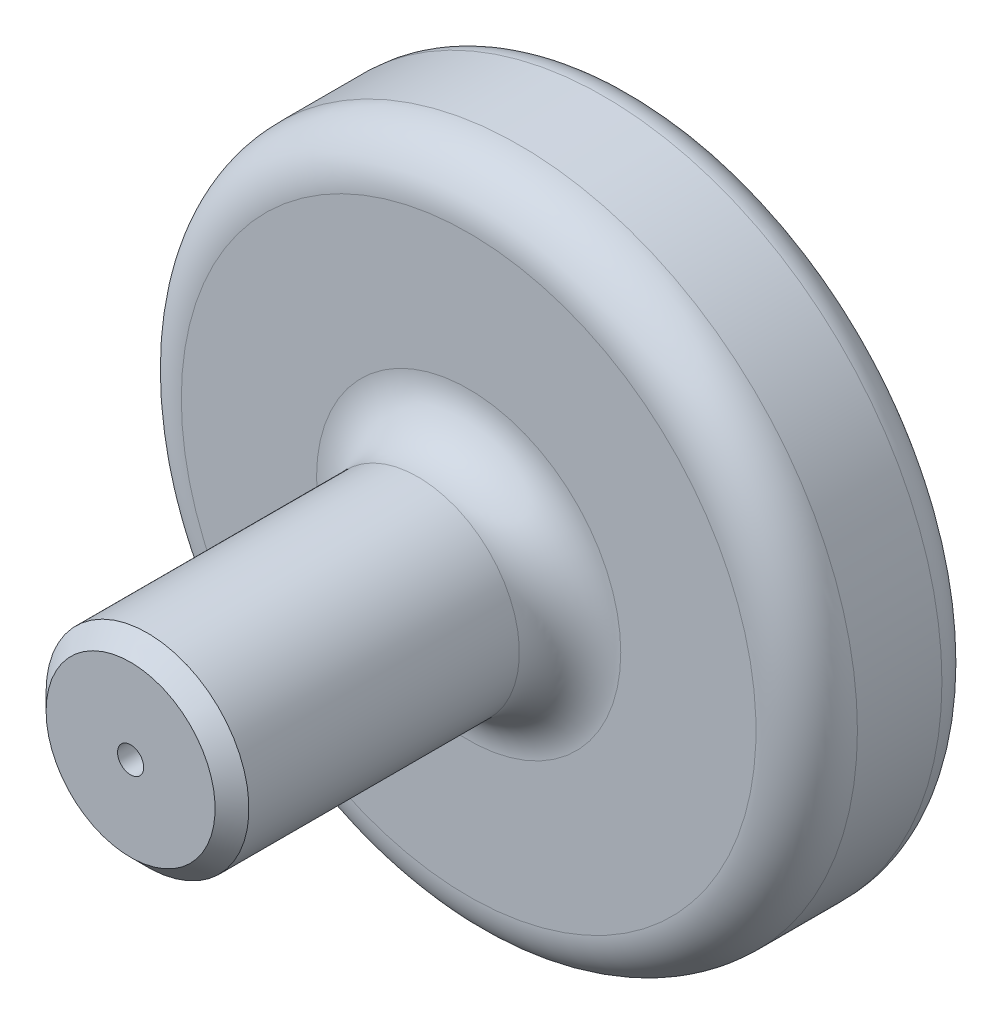
ISO-10303-21;
HEADER;
FILE_DESCRIPTION(('STEP AP214'),'2;1');
FILE_NAME('part.step','',(''),(''),'','','');
FILE_SCHEMA(('AUTOMOTIVE_DESIGN { 1 0 10303 214 1 1 1 1 }'));
ENDSEC;
DATA;
#1=APPLICATION_CONTEXT('core data for automotive mechanical design processes');
#2=APPLICATION_PROTOCOL_DEFINITION('international standard','automotive_design',2000,#1);
#3=PRODUCT_CONTEXT('',#1,'mechanical');
#4=PRODUCT('Part','Part','',(#3));
#5=PRODUCT_RELATED_PRODUCT_CATEGORY('part','',(#4));
#6=PRODUCT_DEFINITION_FORMATION('','',#4);
#7=PRODUCT_DEFINITION_CONTEXT('part definition',#1,'design');
#8=PRODUCT_DEFINITION('design','',#6,#7);
#9=PRODUCT_DEFINITION_SHAPE('','',#8);
#10=(LENGTH_UNIT() NAMED_UNIT(*) SI_UNIT(.MILLI.,.METRE.));
#11=(NAMED_UNIT(*) PLANE_ANGLE_UNIT() SI_UNIT($,.RADIAN.));
#12=(NAMED_UNIT(*) SI_UNIT($,.STERADIAN.) SOLID_ANGLE_UNIT());
#13=UNCERTAINTY_MEASURE_WITH_UNIT(LENGTH_MEASURE(1.E-05),#10,'distance_accuracy_value','');
#14=(GEOMETRIC_REPRESENTATION_CONTEXT(3) GLOBAL_UNCERTAINTY_ASSIGNED_CONTEXT((#13)) GLOBAL_UNIT_ASSIGNED_CONTEXT((#10,
#11,#12)) REPRESENTATION_CONTEXT('',''));
#15=CARTESIAN_POINT('',(0.,0.,0.));
#16=DIRECTION('',(0.,0.,1.));
#17=DIRECTION('',(1.,0.,0.));
#18=AXIS2_PLACEMENT_3D('',#15,#16,#17);
#19=CARTESIAN_POINT('',(0.,0.,0.));
#20=DIRECTION('',(0.,0.,1.));
#21=DIRECTION('',(1.,0.,0.));
#22=AXIS2_PLACEMENT_3D('',#19,#20,#21);
#23=PLANE('',#22);
#24=CARTESIAN_POINT('',(0.,0.,0.));
#25=DIRECTION('',(0.,0.,1.));
#26=DIRECTION('',(1.,0.,0.));
#27=AXIS2_PLACEMENT_3D('',#24,#25,#26);
#28=CIRCLE('',#27,3.86024237262293);
#29=CARTESIAN_POINT('',(3.86024237262293,0.,0.));
#30=VERTEX_POINT('',#29);
#31=EDGE_CURVE('E63',#30,#30,#28,.T.);
#32=ORIENTED_EDGE('',*,*,#31,.T.);
#33=EDGE_LOOP('',(#32));
#34=FACE_BOUND('',#33,.T.);
#35=CARTESIAN_POINT('',(0.,0.,0.));
#36=DIRECTION('',(0.,0.,1.));
#37=DIRECTION('',(1.,0.,0.));
#38=AXIS2_PLACEMENT_3D('',#35,#36,#37);
#39=CIRCLE('',#38,90.);
#40=CARTESIAN_POINT('',(90.,0.,0.));
#41=VERTEX_POINT('',#40);
#42=EDGE_CURVE('E60',#41,#41,#39,.F.);
#43=ORIENTED_EDGE('',*,*,#42,.T.);
#44=EDGE_LOOP('',(#43));
#45=FACE_BOUND('',#44,.T.);
#46=ADVANCED_FACE('F31',(#34,#45),#23,.F.);
#47=CARTESIAN_POINT('',(0.,0.,-26.9597636176773));
#48=DIRECTION('',(0.,0.,-1.));
#49=DIRECTION('',(-1.,0.,0.));
#50=AXIS2_PLACEMENT_3D('',#47,#48,#49);
#51=CYLINDRICAL_SURFACE('',#50,100.);
#52=CARTESIAN_POINT('',(0.,0.,35.));
#53=DIRECTION('',(0.,0.,-1.));
#54=DIRECTION('',(-1.,0.,0.));
#55=AXIS2_PLACEMENT_3D('',#52,#53,#54);
#56=CIRCLE('',#55,100.);
#57=CARTESIAN_POINT('',(-100.,0.,35.));
#58=VERTEX_POINT('',#57);
#59=EDGE_CURVE('E10',#58,#58,#56,.T.);
#60=ORIENTED_EDGE('',*,*,#59,.T.);
#61=EDGE_LOOP('',(#60));
#62=FACE_BOUND('',#61,.T.);
#63=CARTESIAN_POINT('',(0.,0.,10.));
#64=DIRECTION('',(0.,0.,1.));
#65=DIRECTION('',(1.,0.,0.));
#66=AXIS2_PLACEMENT_3D('',#63,#64,#65);
#67=CIRCLE('',#66,100.);
#68=CARTESIAN_POINT('',(100.,0.,10.));
#69=VERTEX_POINT('',#68);
#70=EDGE_CURVE('E57',#69,#69,#67,.T.);
#71=ORIENTED_EDGE('',*,*,#70,.T.);
#72=EDGE_LOOP('',(#71));
#73=FACE_BOUND('',#72,.T.);
#74=ADVANCED_FACE('F99',(#62,#73),#51,.T.);
#75=CARTESIAN_POINT('',(100.,0.,50.));
#76=DIRECTION('',(0.,0.,-1.));
#77=DIRECTION('',(-1.,0.,0.));
#78=AXIS2_PLACEMENT_3D('',#75,#76,#77);
#79=PLANE('',#78);
#80=CARTESIAN_POINT('',(0.,0.,50.));
#81=DIRECTION('',(0.,0.,-1.));
#82=DIRECTION('',(-1.,0.,0.));
#83=AXIS2_PLACEMENT_3D('',#80,#81,#82);
#84=CIRCLE('',#83,45.);
#85=CARTESIAN_POINT('',(-45.,0.,50.));
#86=VERTEX_POINT('',#85);
#87=EDGE_CURVE('E42',#86,#86,#84,.T.);
#88=ORIENTED_EDGE('',*,*,#87,.T.);
#89=EDGE_LOOP('',(#88));
#90=FACE_BOUND('',#89,.T.);
#91=CARTESIAN_POINT('',(0.,0.,50.));
#92=DIRECTION('',(0.,0.,-1.));
#93=DIRECTION('',(-1.,0.,0.));
#94=AXIS2_PLACEMENT_3D('',#91,#92,#93);
#95=CIRCLE('',#94,85.);
#96=CARTESIAN_POINT('',(-85.,0.,50.));
#97=VERTEX_POINT('',#96);
#98=EDGE_CURVE('E46',#97,#97,#95,.F.);
#99=ORIENTED_EDGE('',*,*,#98,.T.);
#100=EDGE_LOOP('',(#99));
#101=FACE_BOUND('',#100,.T.);
#102=ADVANCED_FACE('F94',(#90,#101),#79,.F.);
#103=CARTESIAN_POINT('',(0.,0.,-26.9597636176773));
#104=DIRECTION('',(0.,0.,-1.));
#105=DIRECTION('',(-1.,0.,0.));
#106=AXIS2_PLACEMENT_3D('',#103,#104,#105);
#107=CYLINDRICAL_SURFACE('',#106,30.);
#108=CARTESIAN_POINT('',(0.,0.,65.));
#109=DIRECTION('',(0.,0.,-1.));
#110=DIRECTION('',(-1.,0.,0.));
#111=AXIS2_PLACEMENT_3D('',#108,#109,#110);
#112=CIRCLE('',#111,30.);
#113=CARTESIAN_POINT('',(-30.,0.,65.));
#114=VERTEX_POINT('',#113);
#115=EDGE_CURVE('E38',#114,#114,#112,.F.);
#116=ORIENTED_EDGE('',*,*,#115,.T.);
#117=EDGE_LOOP('',(#116));
#118=FACE_BOUND('',#117,.T.);
#119=CARTESIAN_POINT('',(0.,0.,145.));
#120=DIRECTION('',(0.,0.,-1.));
#121=DIRECTION('',(-1.,0.,0.));
#122=AXIS2_PLACEMENT_3D('',#119,#120,#121);
#123=CIRCLE('',#122,30.);
#124=CARTESIAN_POINT('',(-30.,0.,145.));
#125=VERTEX_POINT('',#124);
#126=EDGE_CURVE('E54',#125,#125,#123,.T.);
#127=ORIENTED_EDGE('',*,*,#126,.T.);
#128=EDGE_LOOP('',(#127));
#129=FACE_BOUND('',#128,.T.);
#130=ADVANCED_FACE('F82',(#118,#129),#107,.T.);
#131=CARTESIAN_POINT('',(30.,0.,150.));
#132=DIRECTION('',(0.,0.,-1.));
#133=DIRECTION('',(-1.,0.,0.));
#134=AXIS2_PLACEMENT_3D('',#131,#132,#133);
#135=PLANE('',#134);
#136=CARTESIAN_POINT('',(0.,0.,150.));
#137=DIRECTION('',(0.,0.,1.));
#138=DIRECTION('',(1.,0.,0.));
#139=AXIS2_PLACEMENT_3D('',#136,#137,#138);
#140=CIRCLE('',#139,3.86024237262293);
#141=CARTESIAN_POINT('',(3.86024237262293,0.,150.));
#142=VERTEX_POINT('',#141);
#143=EDGE_CURVE('E64',#142,#142,#140,.T.);
#144=ORIENTED_EDGE('',*,*,#143,.F.);
#145=EDGE_LOOP('',(#144));
#146=FACE_BOUND('',#145,.T.);
#147=CARTESIAN_POINT('',(0.,0.,150.));
#148=DIRECTION('',(0.,0.,-1.));
#149=DIRECTION('',(-1.,0.,0.));
#150=AXIS2_PLACEMENT_3D('',#147,#148,#149);
#151=CIRCLE('',#150,25.0000000000001);
#152=CARTESIAN_POINT('',(-25.0000000000001,0.,150.));
#153=VERTEX_POINT('',#152);
#154=EDGE_CURVE('E51',#153,#153,#151,.F.);
#155=ORIENTED_EDGE('',*,*,#154,.T.);
#156=EDGE_LOOP('',(#155));
#157=FACE_BOUND('',#156,.T.);
#158=ADVANCED_FACE('F78',(#146,#157),#135,.F.);
#159=CARTESIAN_POINT('',(0.,0.,10.));
#160=DIRECTION('',(0.,0.,1.));
#161=DIRECTION('',(1.,0.,0.));
#162=AXIS2_PLACEMENT_3D('',#159,#160,#161);
#163=TOROIDAL_SURFACE('',#162,90.,10.);
#164=ORIENTED_EDGE('',*,*,#70,.F.);
#165=EDGE_LOOP('',(#164));
#166=FACE_BOUND('',#165,.T.);
#167=ORIENTED_EDGE('',*,*,#42,.F.);
#168=EDGE_LOOP('',(#167));
#169=FACE_BOUND('',#168,.T.);
#170=ADVANCED_FACE('F81',(#166,#169),#163,.T.);
#171=CARTESIAN_POINT('',(0.,0.,145.));
#172=DIRECTION('',(0.,0.,-1.));
#173=DIRECTION('',(-1.,0.,0.));
#174=AXIS2_PLACEMENT_3D('',#171,#172,#173);
#175=CONICAL_SURFACE('',#174,30.,0.785398163397455);
#176=ORIENTED_EDGE('',*,*,#154,.F.);
#177=EDGE_LOOP('',(#176));
#178=FACE_BOUND('',#177,.T.);
#179=ORIENTED_EDGE('',*,*,#126,.F.);
#180=EDGE_LOOP('',(#179));
#181=FACE_BOUND('',#180,.T.);
#182=ADVANCED_FACE('F86',(#178,#181),#175,.T.);
#183=CARTESIAN_POINT('',(0.,0.,65.));
#184=DIRECTION('',(0.,0.,-1.));
#185=DIRECTION('',(-1.,0.,0.));
#186=AXIS2_PLACEMENT_3D('',#183,#184,#185);
#187=TOROIDAL_SURFACE('',#186,45.,15.);
#188=ORIENTED_EDGE('',*,*,#115,.F.);
#189=EDGE_LOOP('',(#188));
#190=FACE_BOUND('',#189,.T.);
#191=ORIENTED_EDGE('',*,*,#87,.F.);
#192=EDGE_LOOP('',(#191));
#193=FACE_BOUND('',#192,.T.);
#194=ADVANCED_FACE('F89',(#190,#193),#187,.F.);
#195=CARTESIAN_POINT('',(0.,0.,35.));
#196=DIRECTION('',(0.,0.,-1.));
#197=DIRECTION('',(-1.,0.,0.));
#198=AXIS2_PLACEMENT_3D('',#195,#196,#197);
#199=TOROIDAL_SURFACE('',#198,85.,15.);
#200=ORIENTED_EDGE('',*,*,#98,.F.);
#201=EDGE_LOOP('',(#200));
#202=FACE_BOUND('',#201,.T.);
#203=ORIENTED_EDGE('',*,*,#59,.F.);
#204=EDGE_LOOP('',(#203));
#205=FACE_BOUND('',#204,.T.);
#206=ADVANCED_FACE('F33',(#202,#205),#199,.T.);
#207=CARTESIAN_POINT('',(0.,0.,0.));
#208=DIRECTION('',(0.,0.,1.));
#209=DIRECTION('',(1.,0.,0.));
#210=AXIS2_PLACEMENT_3D('',#207,#208,#209);
#211=CYLINDRICAL_SURFACE('',#210,3.86024237262293);
#212=ORIENTED_EDGE('',*,*,#31,.F.);
#213=EDGE_LOOP('',(#212));
#214=FACE_BOUND('',#213,.T.);
#215=ORIENTED_EDGE('',*,*,#143,.T.);
#216=EDGE_LOOP('',(#215));
#217=FACE_BOUND('',#216,.T.);
#218=ADVANCED_FACE('F72',(#214,#217),#211,.F.);
#219=CLOSED_SHELL('',(#46,#74,#102,#130,#158,#170,#182,#194,#206,#218));
#220=MANIFOLD_SOLID_BREP('B2',#219);
#221=ADVANCED_BREP_SHAPE_REPRESENTATION('',(#18,#220),#14);
#222=SHAPE_DEFINITION_REPRESENTATION(#9,#221);
ENDSEC;
END-ISO-10303-21;
